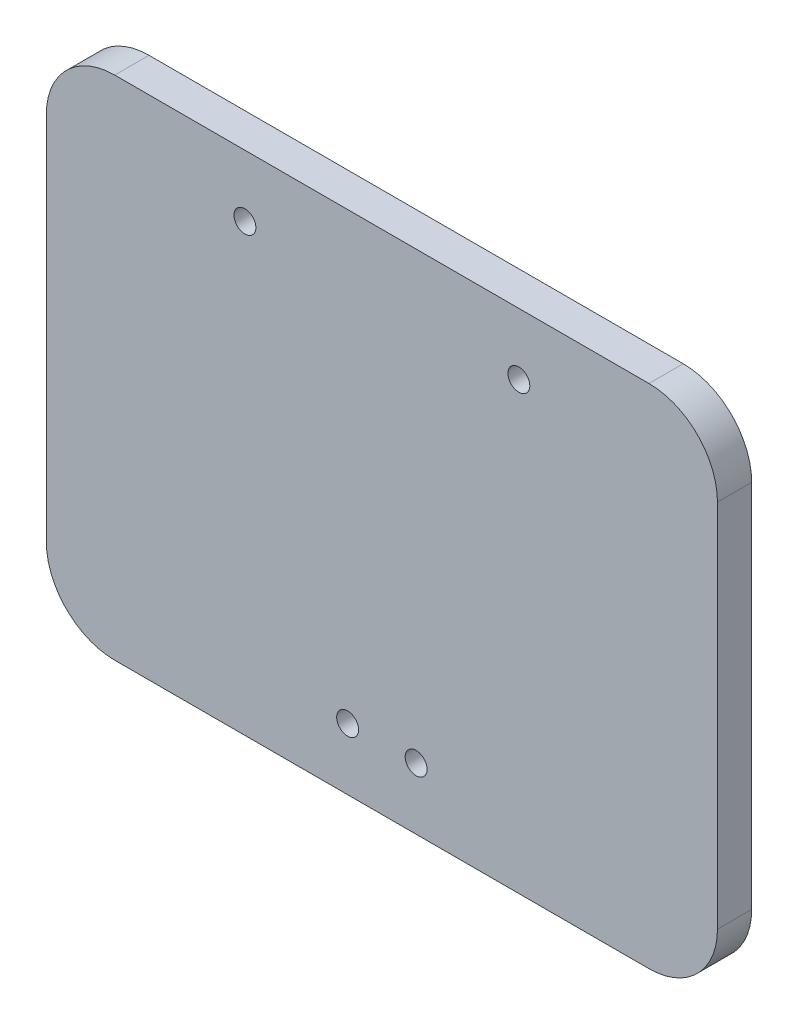
ISO-10303-21;
HEADER;
FILE_DESCRIPTION(('STEP AP214'),'2;1');
FILE_NAME('part.step','',(''),(''),'','','');
FILE_SCHEMA(('AUTOMOTIVE_DESIGN { 1 0 10303 214 1 1 1 1 }'));
ENDSEC;
DATA;
#1=APPLICATION_CONTEXT('core data for automotive mechanical design processes');
#2=APPLICATION_PROTOCOL_DEFINITION('international standard','automotive_design',2000,#1);
#3=PRODUCT_CONTEXT('',#1,'mechanical');
#4=PRODUCT('Part','Part','',(#3));
#5=PRODUCT_RELATED_PRODUCT_CATEGORY('part','',(#4));
#6=PRODUCT_DEFINITION_FORMATION('','',#4);
#7=PRODUCT_DEFINITION_CONTEXT('part definition',#1,'design');
#8=PRODUCT_DEFINITION('design','',#6,#7);
#9=PRODUCT_DEFINITION_SHAPE('','',#8);
#10=(LENGTH_UNIT() NAMED_UNIT(*) SI_UNIT(.MILLI.,.METRE.));
#11=(NAMED_UNIT(*) PLANE_ANGLE_UNIT() SI_UNIT($,.RADIAN.));
#12=(NAMED_UNIT(*) SI_UNIT($,.STERADIAN.) SOLID_ANGLE_UNIT());
#13=UNCERTAINTY_MEASURE_WITH_UNIT(LENGTH_MEASURE(1.E-05),#10,'distance_accuracy_value','');
#14=(GEOMETRIC_REPRESENTATION_CONTEXT(3) GLOBAL_UNCERTAINTY_ASSIGNED_CONTEXT((#13)) GLOBAL_UNIT_ASSIGNED_CONTEXT((#10,
#11,#12)) REPRESENTATION_CONTEXT('',''));
#15=CARTESIAN_POINT('',(0.,0.,0.));
#16=DIRECTION('',(0.,0.,1.));
#17=DIRECTION('',(1.,0.,0.));
#18=AXIS2_PLACEMENT_3D('',#15,#16,#17);
#19=CARTESIAN_POINT('',(-39.,-27.,5.));
#20=DIRECTION('',(0.,0.,-1.));
#21=DIRECTION('',(-1.,0.,0.));
#22=AXIS2_PLACEMENT_3D('',#19,#20,#21);
#23=CYLINDRICAL_SURFACE('',#22,10.);
#24=CARTESIAN_POINT('',(-39.,-27.,0.));
#25=DIRECTION('',(0.,0.,1.));
#26=DIRECTION('',(1.,0.,0.));
#27=AXIS2_PLACEMENT_3D('',#24,#25,#26);
#28=CIRCLE('',#27,10.);
#29=CARTESIAN_POINT('',(-49.,-26.9999999999999,0.));
#30=VERTEX_POINT('',#29);
#31=CARTESIAN_POINT('',(-38.9999999999999,-37.,0.));
#32=VERTEX_POINT('',#31);
#33=EDGE_CURVE('E129',#30,#32,#28,.T.);
#34=ORIENTED_EDGE('',*,*,#33,.T.);
#35=DIRECTION('',(0.,0.,-1.));
#36=VECTOR('',#35,1.);
#37=CARTESIAN_POINT('',(-38.9999999999999,-37.,5.));
#38=LINE('',#37,#36);
#39=CARTESIAN_POINT('',(-38.9999999999999,-37.,5.));
#40=VERTEX_POINT('',#39);
#41=EDGE_CURVE('E11',#40,#32,#38,.T.);
#42=ORIENTED_EDGE('',*,*,#41,.F.);
#43=CARTESIAN_POINT('',(-39.,-27.,5.));
#44=DIRECTION('',(0.,0.,1.));
#45=DIRECTION('',(1.,0.,0.));
#46=AXIS2_PLACEMENT_3D('',#43,#44,#45);
#47=CIRCLE('',#46,10.);
#48=CARTESIAN_POINT('',(-49.,-26.9999999999999,5.));
#49=VERTEX_POINT('',#48);
#50=EDGE_CURVE('E144',#49,#40,#47,.T.);
#51=ORIENTED_EDGE('',*,*,#50,.F.);
#52=DIRECTION('',(0.,0.,-1.));
#53=VECTOR('',#52,1.);
#54=CARTESIAN_POINT('',(-49.,-26.9999999999999,5.));
#55=LINE('',#54,#53);
#56=EDGE_CURVE('E125',#49,#30,#55,.T.);
#57=ORIENTED_EDGE('',*,*,#56,.T.);
#58=EDGE_LOOP('',(#34,#42,#51,#57));
#59=FACE_BOUND('',#58,.T.);
#60=ADVANCED_FACE('F33',(#59),#23,.T.);
#61=CARTESIAN_POINT('',(-38.9999999999999,-37.,5.));
#62=DIRECTION('',(0.,1.,0.));
#63=DIRECTION('',(0.,0.,1.));
#64=AXIS2_PLACEMENT_3D('',#61,#62,#63);
#65=PLANE('',#64);
#66=DIRECTION('',(1.,0.,0.));
#67=VECTOR('',#66,1.);
#68=CARTESIAN_POINT('',(-38.9999999999999,-37.,0.));
#69=LINE('',#68,#67);
#70=CARTESIAN_POINT('',(38.9999999999999,-37.,0.));
#71=VERTEX_POINT('',#70);
#72=EDGE_CURVE('E132',#32,#71,#69,.T.);
#73=ORIENTED_EDGE('',*,*,#72,.T.);
#74=DIRECTION('',(0.,0.,-1.));
#75=VECTOR('',#74,1.);
#76=CARTESIAN_POINT('',(38.9999999999999,-37.,5.));
#77=LINE('',#76,#75);
#78=CARTESIAN_POINT('',(38.9999999999999,-37.,5.));
#79=VERTEX_POINT('',#78);
#80=EDGE_CURVE('E41',#79,#71,#77,.T.);
#81=ORIENTED_EDGE('',*,*,#80,.F.);
#82=DIRECTION('',(1.,0.,0.));
#83=VECTOR('',#82,1.);
#84=CARTESIAN_POINT('',(-38.9999999999999,-37.,5.));
#85=LINE('',#84,#83);
#86=EDGE_CURVE('E92',#40,#79,#85,.T.);
#87=ORIENTED_EDGE('',*,*,#86,.F.);
#88=ORIENTED_EDGE('',*,*,#41,.T.);
#89=EDGE_LOOP('',(#73,#81,#87,#88));
#90=FACE_BOUND('',#89,.T.);
#91=ADVANCED_FACE('F229',(#90),#65,.F.);
#92=CARTESIAN_POINT('',(39.,-27.,5.));
#93=DIRECTION('',(0.,0.,-1.));
#94=DIRECTION('',(-1.,0.,0.));
#95=AXIS2_PLACEMENT_3D('',#92,#93,#94);
#96=CYLINDRICAL_SURFACE('',#95,10.);
#97=CARTESIAN_POINT('',(39.,-27.,0.));
#98=DIRECTION('',(0.,0.,1.));
#99=DIRECTION('',(1.,0.,0.));
#100=AXIS2_PLACEMENT_3D('',#97,#98,#99);
#101=CIRCLE('',#100,10.);
#102=CARTESIAN_POINT('',(49.,-26.9999999999999,0.));
#103=VERTEX_POINT('',#102);
#104=EDGE_CURVE('E135',#71,#103,#101,.T.);
#105=ORIENTED_EDGE('',*,*,#104,.T.);
#106=DIRECTION('',(0.,0.,-1.));
#107=VECTOR('',#106,1.);
#108=CARTESIAN_POINT('',(49.,-26.9999999999999,5.));
#109=LINE('',#108,#107);
#110=CARTESIAN_POINT('',(49.,-26.9999999999999,5.));
#111=VERTEX_POINT('',#110);
#112=EDGE_CURVE('E151',#111,#103,#109,.T.);
#113=ORIENTED_EDGE('',*,*,#112,.F.);
#114=CARTESIAN_POINT('',(39.,-27.,5.));
#115=DIRECTION('',(0.,0.,1.));
#116=DIRECTION('',(1.,0.,0.));
#117=AXIS2_PLACEMENT_3D('',#114,#115,#116);
#118=CIRCLE('',#117,10.);
#119=EDGE_CURVE('E159',#79,#111,#118,.T.);
#120=ORIENTED_EDGE('',*,*,#119,.F.);
#121=ORIENTED_EDGE('',*,*,#80,.T.);
#122=EDGE_LOOP('',(#105,#113,#120,#121));
#123=FACE_BOUND('',#122,.T.);
#124=ADVANCED_FACE('F157',(#123),#96,.T.);
#125=CARTESIAN_POINT('',(49.,26.9999999999999,5.));
#126=DIRECTION('',(-1.,0.,0.));
#127=DIRECTION('',(0.,-1.,0.));
#128=AXIS2_PLACEMENT_3D('',#125,#126,#127);
#129=PLANE('',#128);
#130=DIRECTION('',(0.,1.,0.));
#131=VECTOR('',#130,1.);
#132=CARTESIAN_POINT('',(49.,26.9999999999999,0.));
#133=LINE('',#132,#131);
#134=CARTESIAN_POINT('',(49.,26.9999999999999,0.));
#135=VERTEX_POINT('',#134);
#136=EDGE_CURVE('E137',#103,#135,#133,.T.);
#137=ORIENTED_EDGE('',*,*,#136,.T.);
#138=DIRECTION('',(0.,0.,-1.));
#139=VECTOR('',#138,1.);
#140=CARTESIAN_POINT('',(49.,26.9999999999999,5.));
#141=LINE('',#140,#139);
#142=CARTESIAN_POINT('',(49.,26.9999999999999,5.));
#143=VERTEX_POINT('',#142);
#144=EDGE_CURVE('E148',#143,#135,#141,.T.);
#145=ORIENTED_EDGE('',*,*,#144,.F.);
#146=DIRECTION('',(0.,1.,0.));
#147=VECTOR('',#146,1.);
#148=CARTESIAN_POINT('',(49.,26.9999999999999,5.));
#149=LINE('',#148,#147);
#150=EDGE_CURVE('E171',#111,#143,#149,.T.);
#151=ORIENTED_EDGE('',*,*,#150,.F.);
#152=ORIENTED_EDGE('',*,*,#112,.T.);
#153=EDGE_LOOP('',(#137,#145,#151,#152));
#154=FACE_BOUND('',#153,.T.);
#155=ADVANCED_FACE('F167',(#154),#129,.F.);
#156=CARTESIAN_POINT('',(39.,27.,5.));
#157=DIRECTION('',(0.,0.,-1.));
#158=DIRECTION('',(-1.,0.,0.));
#159=AXIS2_PLACEMENT_3D('',#156,#157,#158);
#160=CYLINDRICAL_SURFACE('',#159,10.);
#161=CARTESIAN_POINT('',(39.,27.,0.));
#162=DIRECTION('',(0.,0.,1.));
#163=DIRECTION('',(-1.,0.,0.));
#164=AXIS2_PLACEMENT_3D('',#161,#162,#163);
#165=CIRCLE('',#164,10.);
#166=CARTESIAN_POINT('',(38.9999999999999,37.,0.));
#167=VERTEX_POINT('',#166);
#168=EDGE_CURVE('E139',#135,#167,#165,.T.);
#169=ORIENTED_EDGE('',*,*,#168,.T.);
#170=DIRECTION('',(0.,0.,-1.));
#171=VECTOR('',#170,1.);
#172=CARTESIAN_POINT('',(38.9999999999999,37.,5.));
#173=LINE('',#172,#171);
#174=CARTESIAN_POINT('',(38.9999999999999,37.,5.));
#175=VERTEX_POINT('',#174);
#176=EDGE_CURVE('E120',#175,#167,#173,.T.);
#177=ORIENTED_EDGE('',*,*,#176,.F.);
#178=CARTESIAN_POINT('',(39.,27.,5.));
#179=DIRECTION('',(0.,0.,1.));
#180=DIRECTION('',(-1.,0.,0.));
#181=AXIS2_PLACEMENT_3D('',#178,#179,#180);
#182=CIRCLE('',#181,10.);
#183=EDGE_CURVE('E111',#143,#175,#182,.T.);
#184=ORIENTED_EDGE('',*,*,#183,.F.);
#185=ORIENTED_EDGE('',*,*,#144,.T.);
#186=EDGE_LOOP('',(#169,#177,#184,#185));
#187=FACE_BOUND('',#186,.T.);
#188=ADVANCED_FACE('F170',(#187),#160,.T.);
#189=CARTESIAN_POINT('',(-38.9999999999999,37.,5.));
#190=DIRECTION('',(0.,-1.,0.));
#191=DIRECTION('',(0.,0.,-1.));
#192=AXIS2_PLACEMENT_3D('',#189,#190,#191);
#193=PLANE('',#192);
#194=DIRECTION('',(-1.,0.,0.));
#195=VECTOR('',#194,1.);
#196=CARTESIAN_POINT('',(-38.9999999999999,37.,0.));
#197=LINE('',#196,#195);
#198=CARTESIAN_POINT('',(-38.9999999999999,37.,0.));
#199=VERTEX_POINT('',#198);
#200=EDGE_CURVE('E119',#167,#199,#197,.T.);
#201=ORIENTED_EDGE('',*,*,#200,.T.);
#202=DIRECTION('',(0.,0.,-1.));
#203=VECTOR('',#202,1.);
#204=CARTESIAN_POINT('',(-38.9999999999999,37.,5.));
#205=LINE('',#204,#203);
#206=CARTESIAN_POINT('',(-38.9999999999999,37.,5.));
#207=VERTEX_POINT('',#206);
#208=EDGE_CURVE('E116',#207,#199,#205,.T.);
#209=ORIENTED_EDGE('',*,*,#208,.F.);
#210=DIRECTION('',(-1.,0.,0.));
#211=VECTOR('',#210,1.);
#212=CARTESIAN_POINT('',(-38.9999999999999,37.,5.));
#213=LINE('',#212,#211);
#214=EDGE_CURVE('E105',#175,#207,#213,.T.);
#215=ORIENTED_EDGE('',*,*,#214,.F.);
#216=ORIENTED_EDGE('',*,*,#176,.T.);
#217=EDGE_LOOP('',(#201,#209,#215,#216));
#218=FACE_BOUND('',#217,.T.);
#219=ADVANCED_FACE('F117',(#218),#193,.F.);
#220=CARTESIAN_POINT('',(-39.,27.,5.));
#221=DIRECTION('',(0.,0.,-1.));
#222=DIRECTION('',(-1.,0.,0.));
#223=AXIS2_PLACEMENT_3D('',#220,#221,#222);
#224=CYLINDRICAL_SURFACE('',#223,10.);
#225=CARTESIAN_POINT('',(-39.,27.,0.));
#226=DIRECTION('',(0.,0.,1.));
#227=DIRECTION('',(1.,0.,0.));
#228=AXIS2_PLACEMENT_3D('',#225,#226,#227);
#229=CIRCLE('',#228,10.);
#230=CARTESIAN_POINT('',(-49.,26.9999999999999,0.));
#231=VERTEX_POINT('',#230);
#232=EDGE_CURVE('E78',#199,#231,#229,.T.);
#233=ORIENTED_EDGE('',*,*,#232,.T.);
#234=DIRECTION('',(0.,0.,-1.));
#235=VECTOR('',#234,1.);
#236=CARTESIAN_POINT('',(-49.,26.9999999999999,5.));
#237=LINE('',#236,#235);
#238=CARTESIAN_POINT('',(-49.,26.9999999999999,5.));
#239=VERTEX_POINT('',#238);
#240=EDGE_CURVE('E121',#239,#231,#237,.T.);
#241=ORIENTED_EDGE('',*,*,#240,.F.);
#242=CARTESIAN_POINT('',(-39.,27.,5.));
#243=DIRECTION('',(0.,0.,1.));
#244=DIRECTION('',(1.,0.,0.));
#245=AXIS2_PLACEMENT_3D('',#242,#243,#244);
#246=CIRCLE('',#245,10.);
#247=EDGE_CURVE('E109',#207,#239,#246,.T.);
#248=ORIENTED_EDGE('',*,*,#247,.F.);
#249=ORIENTED_EDGE('',*,*,#208,.T.);
#250=EDGE_LOOP('',(#233,#241,#248,#249));
#251=FACE_BOUND('',#250,.T.);
#252=ADVANCED_FACE('F123',(#251),#224,.T.);
#253=CARTESIAN_POINT('',(-49.,26.9999999999999,5.));
#254=DIRECTION('',(1.,0.,0.));
#255=DIRECTION('',(0.,1.,0.));
#256=AXIS2_PLACEMENT_3D('',#253,#254,#255);
#257=PLANE('',#256);
#258=DIRECTION('',(0.,-1.,0.));
#259=VECTOR('',#258,1.);
#260=CARTESIAN_POINT('',(-49.,26.9999999999999,0.));
#261=LINE('',#260,#259);
#262=EDGE_CURVE('E84',#231,#30,#261,.T.);
#263=ORIENTED_EDGE('',*,*,#262,.T.);
#264=ORIENTED_EDGE('',*,*,#56,.F.);
#265=DIRECTION('',(0.,-1.,0.));
#266=VECTOR('',#265,1.);
#267=CARTESIAN_POINT('',(-49.,26.9999999999999,5.));
#268=LINE('',#267,#266);
#269=EDGE_CURVE('E49',#239,#49,#268,.T.);
#270=ORIENTED_EDGE('',*,*,#269,.F.);
#271=ORIENTED_EDGE('',*,*,#240,.T.);
#272=EDGE_LOOP('',(#263,#264,#270,#271));
#273=FACE_BOUND('',#272,.T.);
#274=ADVANCED_FACE('F213',(#273),#257,.F.);
#275=CARTESIAN_POINT('',(-39.,-27.,5.));
#276=DIRECTION('',(0.,0.,1.));
#277=DIRECTION('',(1.,0.,0.));
#278=AXIS2_PLACEMENT_3D('',#275,#276,#277);
#279=PLANE('',#278);
#280=CARTESIAN_POINT('',(20.,28.,5.));
#281=DIRECTION('',(0.,0.,1.));
#282=DIRECTION('',(1.,0.,0.));
#283=AXIS2_PLACEMENT_3D('',#280,#281,#282);
#284=CIRCLE('',#283,1.6);
#285=CARTESIAN_POINT('',(21.6,28.,5.));
#286=VERTEX_POINT('',#285);
#287=EDGE_CURVE('E183',#286,#286,#284,.T.);
#288=ORIENTED_EDGE('',*,*,#287,.F.);
#289=EDGE_LOOP('',(#288));
#290=FACE_BOUND('',#289,.T.);
#291=CARTESIAN_POINT('',(-20.,28.,5.));
#292=DIRECTION('',(0.,0.,1.));
#293=DIRECTION('',(1.,0.,0.));
#294=AXIS2_PLACEMENT_3D('',#291,#292,#293);
#295=CIRCLE('',#294,1.6);
#296=CARTESIAN_POINT('',(-18.4,28.,5.));
#297=VERTEX_POINT('',#296);
#298=EDGE_CURVE('E189',#297,#297,#295,.T.);
#299=ORIENTED_EDGE('',*,*,#298,.F.);
#300=EDGE_LOOP('',(#299));
#301=FACE_BOUND('',#300,.T.);
#302=CARTESIAN_POINT('',(-5.,-28.,5.));
#303=DIRECTION('',(0.,0.,1.));
#304=DIRECTION('',(1.,0.,0.));
#305=AXIS2_PLACEMENT_3D('',#302,#303,#304);
#306=CIRCLE('',#305,1.6);
#307=CARTESIAN_POINT('',(-3.4,-28.,5.));
#308=VERTEX_POINT('',#307);
#309=EDGE_CURVE('E195',#308,#308,#306,.T.);
#310=ORIENTED_EDGE('',*,*,#309,.F.);
#311=EDGE_LOOP('',(#310));
#312=FACE_BOUND('',#311,.T.);
#313=CARTESIAN_POINT('',(5.,-28.,5.));
#314=DIRECTION('',(0.,0.,1.));
#315=DIRECTION('',(1.,0.,0.));
#316=AXIS2_PLACEMENT_3D('',#313,#314,#315);
#317=CIRCLE('',#316,1.6);
#318=CARTESIAN_POINT('',(6.6,-28.,5.));
#319=VERTEX_POINT('',#318);
#320=EDGE_CURVE('E177',#319,#319,#317,.T.);
#321=ORIENTED_EDGE('',*,*,#320,.F.);
#322=EDGE_LOOP('',(#321));
#323=FACE_BOUND('',#322,.T.);
#324=ORIENTED_EDGE('',*,*,#50,.T.);
#325=ORIENTED_EDGE('',*,*,#86,.T.);
#326=ORIENTED_EDGE('',*,*,#119,.T.);
#327=ORIENTED_EDGE('',*,*,#150,.T.);
#328=ORIENTED_EDGE('',*,*,#183,.T.);
#329=ORIENTED_EDGE('',*,*,#214,.T.);
#330=ORIENTED_EDGE('',*,*,#247,.T.);
#331=ORIENTED_EDGE('',*,*,#269,.T.);
#332=EDGE_LOOP('',(#324,#325,#326,#327,#328,#329,#330,#331));
#333=FACE_BOUND('',#332,.T.);
#334=ADVANCED_FACE('F107',(#290,#301,#312,#323,#333),#279,.T.);
#335=CARTESIAN_POINT('',(-39.,-27.,0.));
#336=DIRECTION('',(0.,0.,1.));
#337=DIRECTION('',(1.,0.,0.));
#338=AXIS2_PLACEMENT_3D('',#335,#336,#337);
#339=PLANE('',#338);
#340=CARTESIAN_POINT('',(20.,28.,0.));
#341=DIRECTION('',(0.,0.,1.));
#342=DIRECTION('',(1.,0.,0.));
#343=AXIS2_PLACEMENT_3D('',#340,#341,#342);
#344=CIRCLE('',#343,1.6);
#345=CARTESIAN_POINT('',(21.6,28.,0.));
#346=VERTEX_POINT('',#345);
#347=EDGE_CURVE('E186',#346,#346,#344,.T.);
#348=ORIENTED_EDGE('',*,*,#347,.T.);
#349=EDGE_LOOP('',(#348));
#350=FACE_BOUND('',#349,.T.);
#351=CARTESIAN_POINT('',(-20.,28.,0.));
#352=DIRECTION('',(0.,0.,1.));
#353=DIRECTION('',(1.,0.,0.));
#354=AXIS2_PLACEMENT_3D('',#351,#352,#353);
#355=CIRCLE('',#354,1.6);
#356=CARTESIAN_POINT('',(-18.4,28.,0.));
#357=VERTEX_POINT('',#356);
#358=EDGE_CURVE('E192',#357,#357,#355,.T.);
#359=ORIENTED_EDGE('',*,*,#358,.T.);
#360=EDGE_LOOP('',(#359));
#361=FACE_BOUND('',#360,.T.);
#362=CARTESIAN_POINT('',(-5.,-28.,0.));
#363=DIRECTION('',(0.,0.,1.));
#364=DIRECTION('',(1.,0.,0.));
#365=AXIS2_PLACEMENT_3D('',#362,#363,#364);
#366=CIRCLE('',#365,1.6);
#367=CARTESIAN_POINT('',(-3.4,-28.,0.));
#368=VERTEX_POINT('',#367);
#369=EDGE_CURVE('E180',#368,#368,#366,.T.);
#370=ORIENTED_EDGE('',*,*,#369,.T.);
#371=EDGE_LOOP('',(#370));
#372=FACE_BOUND('',#371,.T.);
#373=CARTESIAN_POINT('',(5.,-28.,0.));
#374=DIRECTION('',(0.,0.,1.));
#375=DIRECTION('',(1.,0.,0.));
#376=AXIS2_PLACEMENT_3D('',#373,#374,#375);
#377=CIRCLE('',#376,1.6);
#378=CARTESIAN_POINT('',(6.6,-28.,0.));
#379=VERTEX_POINT('',#378);
#380=EDGE_CURVE('E133',#379,#379,#377,.T.);
#381=ORIENTED_EDGE('',*,*,#380,.T.);
#382=EDGE_LOOP('',(#381));
#383=FACE_BOUND('',#382,.T.);
#384=ORIENTED_EDGE('',*,*,#33,.F.);
#385=ORIENTED_EDGE('',*,*,#262,.F.);
#386=ORIENTED_EDGE('',*,*,#232,.F.);
#387=ORIENTED_EDGE('',*,*,#200,.F.);
#388=ORIENTED_EDGE('',*,*,#168,.F.);
#389=ORIENTED_EDGE('',*,*,#136,.F.);
#390=ORIENTED_EDGE('',*,*,#104,.F.);
#391=ORIENTED_EDGE('',*,*,#72,.F.);
#392=EDGE_LOOP('',(#384,#385,#386,#387,#388,#389,#390,#391));
#393=FACE_BOUND('',#392,.T.);
#394=ADVANCED_FACE('F163',(#350,#361,#372,#383,#393),#339,.F.);
#395=CARTESIAN_POINT('',(5.,-28.,0.));
#396=DIRECTION('',(0.,0.,1.));
#397=DIRECTION('',(1.,0.,0.));
#398=AXIS2_PLACEMENT_3D('',#395,#396,#397);
#399=CYLINDRICAL_SURFACE('',#398,1.6);
#400=ORIENTED_EDGE('',*,*,#380,.F.);
#401=EDGE_LOOP('',(#400));
#402=FACE_BOUND('',#401,.T.);
#403=ORIENTED_EDGE('',*,*,#320,.T.);
#404=EDGE_LOOP('',(#403));
#405=FACE_BOUND('',#404,.T.);
#406=ADVANCED_FACE('F207',(#402,#405),#399,.F.);
#407=CARTESIAN_POINT('',(-5.,-28.,0.));
#408=DIRECTION('',(0.,0.,1.));
#409=DIRECTION('',(1.,0.,0.));
#410=AXIS2_PLACEMENT_3D('',#407,#408,#409);
#411=CYLINDRICAL_SURFACE('',#410,1.6);
#412=ORIENTED_EDGE('',*,*,#369,.F.);
#413=EDGE_LOOP('',(#412));
#414=FACE_BOUND('',#413,.T.);
#415=ORIENTED_EDGE('',*,*,#309,.T.);
#416=EDGE_LOOP('',(#415));
#417=FACE_BOUND('',#416,.T.);
#418=ADVANCED_FACE('F203',(#414,#417),#411,.F.);
#419=CARTESIAN_POINT('',(-20.,28.,0.));
#420=DIRECTION('',(0.,0.,1.));
#421=DIRECTION('',(1.,0.,0.));
#422=AXIS2_PLACEMENT_3D('',#419,#420,#421);
#423=CYLINDRICAL_SURFACE('',#422,1.6);
#424=ORIENTED_EDGE('',*,*,#358,.F.);
#425=EDGE_LOOP('',(#424));
#426=FACE_BOUND('',#425,.T.);
#427=ORIENTED_EDGE('',*,*,#298,.T.);
#428=EDGE_LOOP('',(#427));
#429=FACE_BOUND('',#428,.T.);
#430=ADVANCED_FACE('F206',(#426,#429),#423,.F.);
#431=CARTESIAN_POINT('',(20.,28.,0.));
#432=DIRECTION('',(0.,0.,1.));
#433=DIRECTION('',(1.,0.,0.));
#434=AXIS2_PLACEMENT_3D('',#431,#432,#433);
#435=CYLINDRICAL_SURFACE('',#434,1.6);
#436=ORIENTED_EDGE('',*,*,#347,.F.);
#437=EDGE_LOOP('',(#436));
#438=FACE_BOUND('',#437,.T.);
#439=ORIENTED_EDGE('',*,*,#287,.T.);
#440=EDGE_LOOP('',(#439));
#441=FACE_BOUND('',#440,.T.);
#442=ADVANCED_FACE('F305',(#438,#441),#435,.F.);
#443=CLOSED_SHELL('',(#60,#91,#124,#155,#188,#219,#252,#274,#334,#394,#406,#418,#430,#442));
#444=MANIFOLD_SOLID_BREP('B2',#443);
#445=ADVANCED_BREP_SHAPE_REPRESENTATION('',(#18,#444),#14);
#446=SHAPE_DEFINITION_REPRESENTATION(#9,#445);
ENDSEC;
END-ISO-10303-21;
